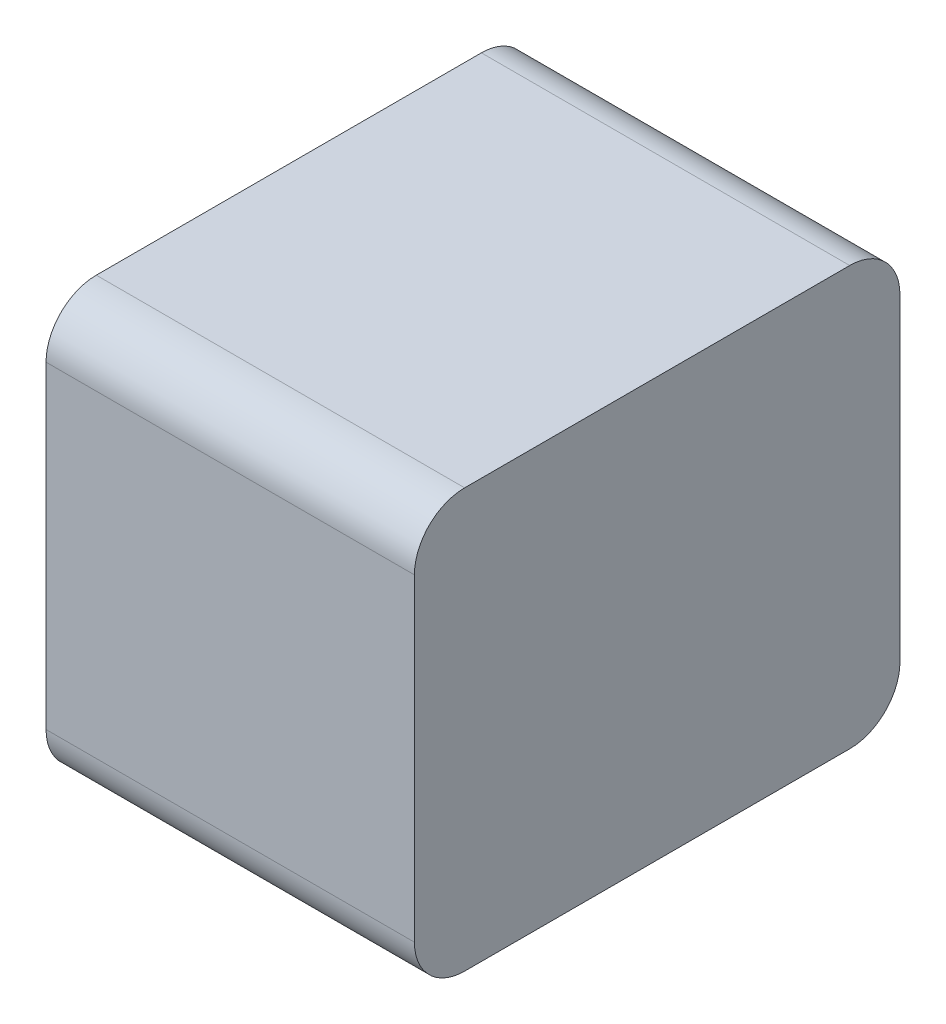
ISO-10303-21;
HEADER;
FILE_DESCRIPTION(('STEP AP214'),'2;1');
FILE_NAME('part.step','',(''),(''),'','','');
FILE_SCHEMA(('AUTOMOTIVE_DESIGN { 1 0 10303 214 1 1 1 1 }'));
ENDSEC;
DATA;
#1=APPLICATION_CONTEXT('core data for automotive mechanical design processes');
#2=APPLICATION_PROTOCOL_DEFINITION('international standard','automotive_design',2000,#1);
#3=PRODUCT_CONTEXT('',#1,'mechanical');
#4=PRODUCT('Part','Part','',(#3));
#5=PRODUCT_RELATED_PRODUCT_CATEGORY('part','',(#4));
#6=PRODUCT_DEFINITION_FORMATION('','',#4);
#7=PRODUCT_DEFINITION_CONTEXT('part definition',#1,'design');
#8=PRODUCT_DEFINITION('design','',#6,#7);
#9=PRODUCT_DEFINITION_SHAPE('','',#8);
#10=(LENGTH_UNIT() NAMED_UNIT(*) SI_UNIT(.MILLI.,.METRE.));
#11=(NAMED_UNIT(*) PLANE_ANGLE_UNIT() SI_UNIT($,.RADIAN.));
#12=(NAMED_UNIT(*) SI_UNIT($,.STERADIAN.) SOLID_ANGLE_UNIT());
#13=UNCERTAINTY_MEASURE_WITH_UNIT(LENGTH_MEASURE(1.E-05),#10,'distance_accuracy_value','');
#14=(GEOMETRIC_REPRESENTATION_CONTEXT(3) GLOBAL_UNCERTAINTY_ASSIGNED_CONTEXT((#13)) GLOBAL_UNIT_ASSIGNED_CONTEXT((#10,
#11,#12)) REPRESENTATION_CONTEXT('',''));
#15=CARTESIAN_POINT('',(0.,0.,0.));
#16=DIRECTION('',(0.,0.,1.));
#17=DIRECTION('',(1.,0.,0.));
#18=AXIS2_PLACEMENT_3D('',#15,#16,#17);
#19=CARTESIAN_POINT('',(0.275,0.475,0.15));
#20=DIRECTION('',(1.,0.,0.));
#21=DIRECTION('',(0.,0.707106781186548,-0.707106781186548));
#22=AXIS2_PLACEMENT_3D('',#19,#20,#21);
#23=CYLINDRICAL_SURFACE('',#22,0.15);
#24=CARTESIAN_POINT('',(0.55,0.475,0.15));
#25=DIRECTION('',(-1.,0.,0.));
#26=DIRECTION('',(0.,1.,0.));
#27=AXIS2_PLACEMENT_3D('',#24,#25,#26);
#28=CIRCLE('',#27,0.15);
#29=CARTESIAN_POINT('',(0.55,0.625,0.15));
#30=VERTEX_POINT('',#29);
#31=CARTESIAN_POINT('',(0.55,0.475,0.));
#32=VERTEX_POINT('',#31);
#33=EDGE_CURVE('E11',#30,#32,#28,.T.);
#34=ORIENTED_EDGE('',*,*,#33,.T.);
#35=DIRECTION('',(-1.,0.,0.));
#36=VECTOR('',#35,1.);
#37=CARTESIAN_POINT('',(0.55,0.475,0.));
#38=LINE('',#37,#36);
#39=CARTESIAN_POINT('',(-0.55,0.475,0.));
#40=VERTEX_POINT('',#39);
#41=EDGE_CURVE('E144',#32,#40,#38,.T.);
#42=ORIENTED_EDGE('',*,*,#41,.T.);
#43=CARTESIAN_POINT('',(-0.55,0.475,0.15));
#44=DIRECTION('',(1.,0.,0.));
#45=DIRECTION('',(0.,0.,-1.));
#46=AXIS2_PLACEMENT_3D('',#43,#44,#45);
#47=CIRCLE('',#46,0.15);
#48=CARTESIAN_POINT('',(-0.55,0.625,0.15));
#49=VERTEX_POINT('',#48);
#50=EDGE_CURVE('E142',#40,#49,#47,.T.);
#51=ORIENTED_EDGE('',*,*,#50,.T.);
#52=DIRECTION('',(1.,0.,0.));
#53=VECTOR('',#52,1.);
#54=CARTESIAN_POINT('',(-0.55,0.625,0.15));
#55=LINE('',#54,#53);
#56=EDGE_CURVE('E24',#49,#30,#55,.T.);
#57=ORIENTED_EDGE('',*,*,#56,.T.);
#58=EDGE_LOOP('',(#34,#42,#51,#57));
#59=FACE_BOUND('',#58,.T.);
#60=ADVANCED_FACE('F17',(#59),#23,.T.);
#61=CARTESIAN_POINT('',(0.55,0.625,0.));
#62=DIRECTION('',(0.,1.,0.));
#63=DIRECTION('',(-1.,0.,0.));
#64=AXIS2_PLACEMENT_3D('',#61,#62,#63);
#65=PLANE('',#64);
#66=ORIENTED_EDGE('',*,*,#56,.F.);
#67=DIRECTION('',(0.,0.,1.));
#68=VECTOR('',#67,1.);
#69=CARTESIAN_POINT('',(-0.55,0.625,0.15));
#70=LINE('',#69,#68);
#71=CARTESIAN_POINT('',(-0.55,0.625,1.3));
#72=VERTEX_POINT('',#71);
#73=EDGE_CURVE('E140',#49,#72,#70,.T.);
#74=ORIENTED_EDGE('',*,*,#73,.T.);
#75=DIRECTION('',(-1.,0.,0.));
#76=VECTOR('',#75,1.);
#77=CARTESIAN_POINT('',(0.55,0.625,1.3));
#78=LINE('',#77,#76);
#79=CARTESIAN_POINT('',(0.55,0.625,1.3));
#80=VERTEX_POINT('',#79);
#81=EDGE_CURVE('E132',#80,#72,#78,.T.);
#82=ORIENTED_EDGE('',*,*,#81,.F.);
#83=DIRECTION('',(0.,0.,1.));
#84=VECTOR('',#83,1.);
#85=CARTESIAN_POINT('',(0.55,0.625,0.15));
#86=LINE('',#85,#84);
#87=EDGE_CURVE('E125',#30,#80,#86,.T.);
#88=ORIENTED_EDGE('',*,*,#87,.F.);
#89=EDGE_LOOP('',(#66,#74,#82,#88));
#90=FACE_BOUND('',#89,.T.);
#91=ADVANCED_FACE('F147',(#90),#65,.T.);
#92=CARTESIAN_POINT('',(-0.55,0.625,0.));
#93=DIRECTION('',(-1.,0.,0.));
#94=DIRECTION('',(0.,-1.,0.));
#95=AXIS2_PLACEMENT_3D('',#92,#93,#94);
#96=PLANE('',#95);
#97=ORIENTED_EDGE('',*,*,#50,.F.);
#98=DIRECTION('',(0.,1.,0.));
#99=VECTOR('',#98,1.);
#100=CARTESIAN_POINT('',(-0.55,-0.475,0.));
#101=LINE('',#100,#99);
#102=CARTESIAN_POINT('',(-0.55,-0.475,0.));
#103=VERTEX_POINT('',#102);
#104=EDGE_CURVE('E135',#103,#40,#101,.T.);
#105=ORIENTED_EDGE('',*,*,#104,.F.);
#106=CARTESIAN_POINT('',(-0.55,-0.475,0.15));
#107=DIRECTION('',(1.,0.,0.));
#108=DIRECTION('',(0.,-1.,0.));
#109=AXIS2_PLACEMENT_3D('',#106,#107,#108);
#110=CIRCLE('',#109,0.15);
#111=CARTESIAN_POINT('',(-0.55,-0.625,0.15));
#112=VERTEX_POINT('',#111);
#113=EDGE_CURVE('E138',#112,#103,#110,.T.);
#114=ORIENTED_EDGE('',*,*,#113,.F.);
#115=DIRECTION('',(0.,0.,1.));
#116=VECTOR('',#115,1.);
#117=CARTESIAN_POINT('',(-0.55,-0.625,0.15));
#118=LINE('',#117,#116);
#119=CARTESIAN_POINT('',(-0.55,-0.625,1.3));
#120=VERTEX_POINT('',#119);
#121=EDGE_CURVE('E118',#112,#120,#118,.T.);
#122=ORIENTED_EDGE('',*,*,#121,.T.);
#123=CARTESIAN_POINT('',(-0.55,-0.475,1.3));
#124=DIRECTION('',(1.,0.,0.));
#125=DIRECTION('',(0.,0.,1.));
#126=AXIS2_PLACEMENT_3D('',#123,#124,#125);
#127=CIRCLE('',#126,0.15);
#128=CARTESIAN_POINT('',(-0.55,-0.475,1.45));
#129=VERTEX_POINT('',#128);
#130=EDGE_CURVE('E113',#129,#120,#127,.T.);
#131=ORIENTED_EDGE('',*,*,#130,.F.);
#132=DIRECTION('',(0.,-1.,0.));
#133=VECTOR('',#132,1.);
#134=CARTESIAN_POINT('',(-0.55,0.475,1.45));
#135=LINE('',#134,#133);
#136=CARTESIAN_POINT('',(-0.55,0.475,1.45));
#137=VERTEX_POINT('',#136);
#138=EDGE_CURVE('E89',#137,#129,#135,.T.);
#139=ORIENTED_EDGE('',*,*,#138,.F.);
#140=CARTESIAN_POINT('',(-0.55,0.475,1.3));
#141=DIRECTION('',(1.,0.,0.));
#142=DIRECTION('',(0.,1.,0.));
#143=AXIS2_PLACEMENT_3D('',#140,#141,#142);
#144=CIRCLE('',#143,0.15);
#145=EDGE_CURVE('E116',#72,#137,#144,.T.);
#146=ORIENTED_EDGE('',*,*,#145,.F.);
#147=ORIENTED_EDGE('',*,*,#73,.F.);
#148=EDGE_LOOP('',(#97,#105,#114,#122,#131,#139,#146,#147));
#149=FACE_BOUND('',#148,.T.);
#150=ADVANCED_FACE('F155',(#149),#96,.T.);
#151=CARTESIAN_POINT('',(-0.275,-0.475,0.15));
#152=DIRECTION('',(-1.,0.,0.));
#153=DIRECTION('',(0.,-0.707106781186548,-0.707106781186548));
#154=AXIS2_PLACEMENT_3D('',#151,#152,#153);
#155=CYLINDRICAL_SURFACE('',#154,0.15);
#156=ORIENTED_EDGE('',*,*,#113,.T.);
#157=DIRECTION('',(1.,0.,0.));
#158=VECTOR('',#157,1.);
#159=CARTESIAN_POINT('',(-0.55,-0.475,0.));
#160=LINE('',#159,#158);
#161=CARTESIAN_POINT('',(0.55,-0.475,0.));
#162=VERTEX_POINT('',#161);
#163=EDGE_CURVE('E127',#103,#162,#160,.T.);
#164=ORIENTED_EDGE('',*,*,#163,.T.);
#165=CARTESIAN_POINT('',(0.55,-0.475,0.15));
#166=DIRECTION('',(-1.,0.,0.));
#167=DIRECTION('',(0.,0.,-1.));
#168=AXIS2_PLACEMENT_3D('',#165,#166,#167);
#169=CIRCLE('',#168,0.15);
#170=CARTESIAN_POINT('',(0.55,-0.625,0.15));
#171=VERTEX_POINT('',#170);
#172=EDGE_CURVE('E120',#162,#171,#169,.T.);
#173=ORIENTED_EDGE('',*,*,#172,.T.);
#174=DIRECTION('',(-1.,0.,0.));
#175=VECTOR('',#174,1.);
#176=CARTESIAN_POINT('',(0.55,-0.625,0.15));
#177=LINE('',#176,#175);
#178=EDGE_CURVE('E129',#171,#112,#177,.T.);
#179=ORIENTED_EDGE('',*,*,#178,.T.);
#180=EDGE_LOOP('',(#156,#164,#173,#179));
#181=FACE_BOUND('',#180,.T.);
#182=ADVANCED_FACE('F177',(#181),#155,.T.);
#183=CARTESIAN_POINT('',(-0.55,-0.625,0.));
#184=DIRECTION('',(0.,-1.,0.));
#185=DIRECTION('',(1.,0.,0.));
#186=AXIS2_PLACEMENT_3D('',#183,#184,#185);
#187=PLANE('',#186);
#188=ORIENTED_EDGE('',*,*,#178,.F.);
#189=DIRECTION('',(0.,0.,1.));
#190=VECTOR('',#189,1.);
#191=CARTESIAN_POINT('',(0.55,-0.625,0.15));
#192=LINE('',#191,#190);
#193=CARTESIAN_POINT('',(0.55,-0.625,1.3));
#194=VERTEX_POINT('',#193);
#195=EDGE_CURVE('E123',#171,#194,#192,.T.);
#196=ORIENTED_EDGE('',*,*,#195,.T.);
#197=DIRECTION('',(1.,0.,0.));
#198=VECTOR('',#197,1.);
#199=CARTESIAN_POINT('',(-0.55,-0.625,1.3));
#200=LINE('',#199,#198);
#201=EDGE_CURVE('E86',#120,#194,#200,.T.);
#202=ORIENTED_EDGE('',*,*,#201,.F.);
#203=ORIENTED_EDGE('',*,*,#121,.F.);
#204=EDGE_LOOP('',(#188,#196,#202,#203));
#205=FACE_BOUND('',#204,.T.);
#206=ADVANCED_FACE('F167',(#205),#187,.T.);
#207=CARTESIAN_POINT('',(0.55,-0.625,0.));
#208=DIRECTION('',(1.,0.,0.));
#209=DIRECTION('',(0.,1.,0.));
#210=AXIS2_PLACEMENT_3D('',#207,#208,#209);
#211=PLANE('',#210);
#212=ORIENTED_EDGE('',*,*,#33,.F.);
#213=ORIENTED_EDGE('',*,*,#87,.T.);
#214=CARTESIAN_POINT('',(0.55,0.475,1.3));
#215=DIRECTION('',(-1.,0.,0.));
#216=DIRECTION('',(0.,0.,1.));
#217=AXIS2_PLACEMENT_3D('',#214,#215,#216);
#218=CIRCLE('',#217,0.15);
#219=CARTESIAN_POINT('',(0.55,0.475,1.45));
#220=VERTEX_POINT('',#219);
#221=EDGE_CURVE('E97',#220,#80,#218,.T.);
#222=ORIENTED_EDGE('',*,*,#221,.F.);
#223=DIRECTION('',(0.,1.,0.));
#224=VECTOR('',#223,1.);
#225=CARTESIAN_POINT('',(0.55,-0.475,1.45));
#226=LINE('',#225,#224);
#227=CARTESIAN_POINT('',(0.55,-0.475,1.45));
#228=VERTEX_POINT('',#227);
#229=EDGE_CURVE('E90',#228,#220,#226,.T.);
#230=ORIENTED_EDGE('',*,*,#229,.F.);
#231=CARTESIAN_POINT('',(0.55,-0.475,1.3));
#232=DIRECTION('',(-1.,0.,0.));
#233=DIRECTION('',(0.,-1.,0.));
#234=AXIS2_PLACEMENT_3D('',#231,#232,#233);
#235=CIRCLE('',#234,0.15);
#236=EDGE_CURVE('E79',#194,#228,#235,.T.);
#237=ORIENTED_EDGE('',*,*,#236,.F.);
#238=ORIENTED_EDGE('',*,*,#195,.F.);
#239=ORIENTED_EDGE('',*,*,#172,.F.);
#240=DIRECTION('',(0.,-1.,0.));
#241=VECTOR('',#240,1.);
#242=CARTESIAN_POINT('',(0.55,0.475,0.));
#243=LINE('',#242,#241);
#244=EDGE_CURVE('E104',#32,#162,#243,.T.);
#245=ORIENTED_EDGE('',*,*,#244,.F.);
#246=EDGE_LOOP('',(#212,#213,#222,#230,#237,#238,#239,#245));
#247=FACE_BOUND('',#246,.T.);
#248=ADVANCED_FACE('F94',(#247),#211,.T.);
#249=CARTESIAN_POINT('',(0.275,0.475,1.3));
#250=DIRECTION('',(-1.,0.,0.));
#251=DIRECTION('',(0.,0.707106781186547,0.707106781186548));
#252=AXIS2_PLACEMENT_3D('',#249,#250,#251);
#253=CYLINDRICAL_SURFACE('',#252,0.15);
#254=ORIENTED_EDGE('',*,*,#145,.T.);
#255=DIRECTION('',(1.,0.,0.));
#256=VECTOR('',#255,1.);
#257=CARTESIAN_POINT('',(-0.55,0.475,1.45));
#258=LINE('',#257,#256);
#259=EDGE_CURVE('E111',#137,#220,#258,.T.);
#260=ORIENTED_EDGE('',*,*,#259,.T.);
#261=ORIENTED_EDGE('',*,*,#221,.T.);
#262=ORIENTED_EDGE('',*,*,#81,.T.);
#263=EDGE_LOOP('',(#254,#260,#261,#262));
#264=FACE_BOUND('',#263,.T.);
#265=ADVANCED_FACE('F158',(#264),#253,.T.);
#266=CARTESIAN_POINT('',(0.,0.,1.45));
#267=DIRECTION('',(0.,0.,1.));
#268=DIRECTION('',(1.,0.,0.));
#269=AXIS2_PLACEMENT_3D('',#266,#267,#268);
#270=PLANE('',#269);
#271=ORIENTED_EDGE('',*,*,#259,.F.);
#272=ORIENTED_EDGE('',*,*,#138,.T.);
#273=DIRECTION('',(-1.,0.,0.));
#274=VECTOR('',#273,1.);
#275=CARTESIAN_POINT('',(0.55,-0.475,1.45));
#276=LINE('',#275,#274);
#277=EDGE_CURVE('E84',#228,#129,#276,.T.);
#278=ORIENTED_EDGE('',*,*,#277,.F.);
#279=ORIENTED_EDGE('',*,*,#229,.T.);
#280=EDGE_LOOP('',(#271,#272,#278,#279));
#281=FACE_BOUND('',#280,.T.);
#282=ADVANCED_FACE('F102',(#281),#270,.T.);
#283=CARTESIAN_POINT('',(-0.275,-0.475,1.3));
#284=DIRECTION('',(1.,0.,0.));
#285=DIRECTION('',(0.,-0.707106781186547,0.707106781186548));
#286=AXIS2_PLACEMENT_3D('',#283,#284,#285);
#287=CYLINDRICAL_SURFACE('',#286,0.15);
#288=ORIENTED_EDGE('',*,*,#236,.T.);
#289=ORIENTED_EDGE('',*,*,#277,.T.);
#290=ORIENTED_EDGE('',*,*,#130,.T.);
#291=ORIENTED_EDGE('',*,*,#201,.T.);
#292=EDGE_LOOP('',(#288,#289,#290,#291));
#293=FACE_BOUND('',#292,.T.);
#294=ADVANCED_FACE('F81',(#293),#287,.T.);
#295=CARTESIAN_POINT('',(0.,0.,0.));
#296=DIRECTION('',(0.,0.,1.));
#297=DIRECTION('',(1.,0.,0.));
#298=AXIS2_PLACEMENT_3D('',#295,#296,#297);
#299=PLANE('',#298);
#300=ORIENTED_EDGE('',*,*,#41,.F.);
#301=ORIENTED_EDGE('',*,*,#244,.T.);
#302=ORIENTED_EDGE('',*,*,#163,.F.);
#303=ORIENTED_EDGE('',*,*,#104,.T.);
#304=EDGE_LOOP('',(#300,#301,#302,#303));
#305=FACE_BOUND('',#304,.T.);
#306=ADVANCED_FACE('F152',(#305),#299,.F.);
#307=CLOSED_SHELL('',(#60,#91,#150,#182,#206,#248,#265,#282,#294,#306));
#308=MANIFOLD_SOLID_BREP('B1',#307);
#309=ADVANCED_BREP_SHAPE_REPRESENTATION('',(#18,#308),#14);
#310=SHAPE_DEFINITION_REPRESENTATION(#9,#309);
ENDSEC;
END-ISO-10303-21;
